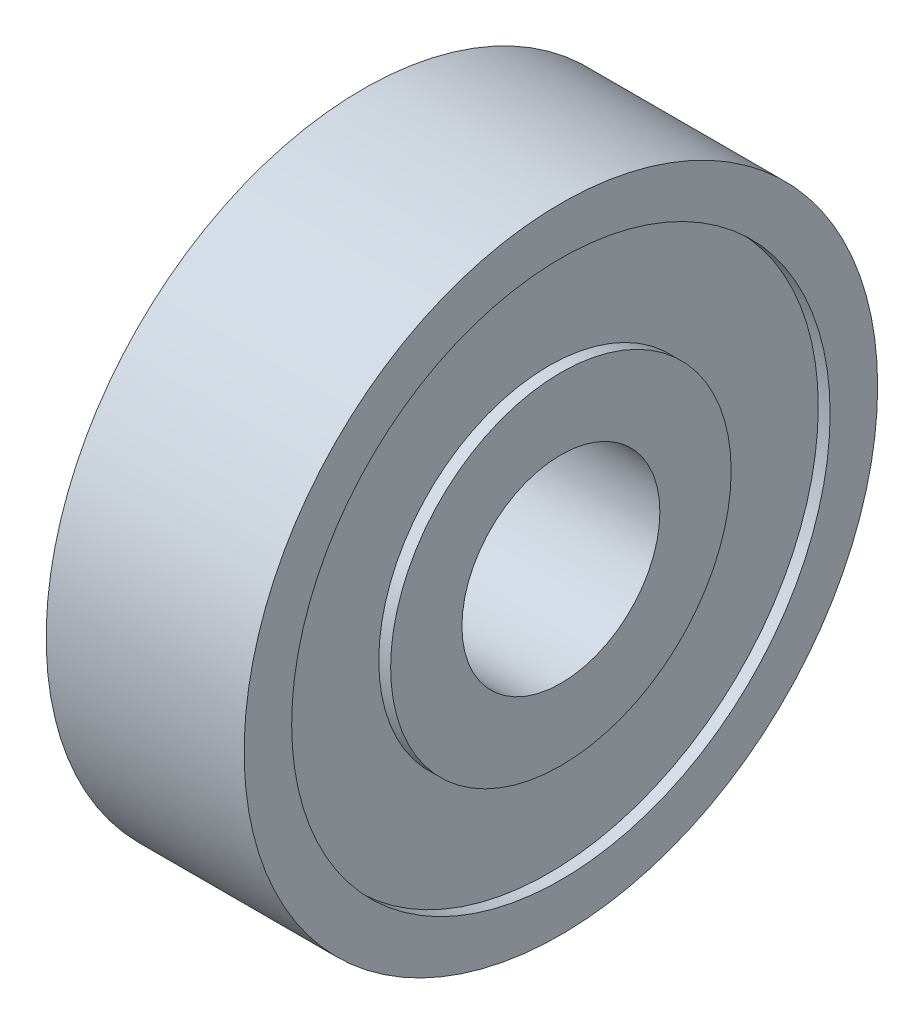
ISO-10303-21;
HEADER;
FILE_DESCRIPTION(('STEP AP214'),'2;1');
FILE_NAME('part.step','',(''),(''),'','','');
FILE_SCHEMA(('AUTOMOTIVE_DESIGN { 1 0 10303 214 1 1 1 1 }'));
ENDSEC;
DATA;
#1=APPLICATION_CONTEXT('core data for automotive mechanical design processes');
#2=APPLICATION_PROTOCOL_DEFINITION('international standard','automotive_design',2000,#1);
#3=PRODUCT_CONTEXT('',#1,'mechanical');
#4=PRODUCT('Part','Part','',(#3));
#5=PRODUCT_RELATED_PRODUCT_CATEGORY('part','',(#4));
#6=PRODUCT_DEFINITION_FORMATION('','',#4);
#7=PRODUCT_DEFINITION_CONTEXT('part definition',#1,'design');
#8=PRODUCT_DEFINITION('design','',#6,#7);
#9=PRODUCT_DEFINITION_SHAPE('','',#8);
#10=(LENGTH_UNIT() NAMED_UNIT(*) SI_UNIT(.MILLI.,.METRE.));
#11=(NAMED_UNIT(*) PLANE_ANGLE_UNIT() SI_UNIT($,.RADIAN.));
#12=(NAMED_UNIT(*) SI_UNIT($,.STERADIAN.) SOLID_ANGLE_UNIT());
#13=UNCERTAINTY_MEASURE_WITH_UNIT(LENGTH_MEASURE(1.E-05),#10,'distance_accuracy_value','');
#14=(GEOMETRIC_REPRESENTATION_CONTEXT(3) GLOBAL_UNCERTAINTY_ASSIGNED_CONTEXT((#13)) GLOBAL_UNIT_ASSIGNED_CONTEXT((#10,
#11,#12)) REPRESENTATION_CONTEXT('',''));
#15=CARTESIAN_POINT('',(0.,0.,0.));
#16=DIRECTION('',(0.,0.,1.));
#17=DIRECTION('',(1.,0.,0.));
#18=AXIS2_PLACEMENT_3D('',#15,#16,#17);
#19=CARTESIAN_POINT('',(-2.5,2.5,0.));
#20=DIRECTION('',(-1.,0.,0.));
#21=DIRECTION('',(0.,0.,1.));
#22=AXIS2_PLACEMENT_3D('',#19,#20,#21);
#23=PLANE('',#22);
#24=CARTESIAN_POINT('',(-2.5,0.,0.));
#25=DIRECTION('',(1.,0.,0.));
#26=DIRECTION('',(0.,0.,-1.));
#27=AXIS2_PLACEMENT_3D('',#24,#25,#26);
#28=CIRCLE('',#27,2.5);
#29=CARTESIAN_POINT('',(-2.5,0.,-2.5));
#30=VERTEX_POINT('',#29);
#31=EDGE_CURVE('E74',#30,#30,#28,.T.);
#32=ORIENTED_EDGE('',*,*,#31,.T.);
#33=EDGE_LOOP('',(#32));
#34=FACE_BOUND('',#33,.T.);
#35=CARTESIAN_POINT('',(-2.5,0.,0.));
#36=DIRECTION('',(1.,0.,0.));
#37=DIRECTION('',(0.,0.,-1.));
#38=AXIS2_PLACEMENT_3D('',#35,#36,#37);
#39=CIRCLE('',#38,4.3);
#40=CARTESIAN_POINT('',(-2.5,0.,-4.3));
#41=VERTEX_POINT('',#40);
#42=EDGE_CURVE('E10',#41,#41,#39,.T.);
#43=ORIENTED_EDGE('',*,*,#42,.F.);
#44=EDGE_LOOP('',(#43));
#45=FACE_BOUND('',#44,.T.);
#46=ADVANCED_FACE('F34',(#34,#45),#23,.T.);
#47=CARTESIAN_POINT('',(0.,0.,0.));
#48=DIRECTION('',(1.,0.,0.));
#49=DIRECTION('',(0.,0.,-1.));
#50=AXIS2_PLACEMENT_3D('',#47,#48,#49);
#51=CYLINDRICAL_SURFACE('',#50,4.3);
#52=ORIENTED_EDGE('',*,*,#42,.T.);
#53=EDGE_LOOP('',(#52));
#54=FACE_BOUND('',#53,.T.);
#55=CARTESIAN_POINT('',(-2.2,0.,0.));
#56=DIRECTION('',(1.,0.,0.));
#57=DIRECTION('',(0.,0.,-1.));
#58=AXIS2_PLACEMENT_3D('',#55,#56,#57);
#59=CIRCLE('',#58,4.3);
#60=CARTESIAN_POINT('',(-2.2,0.,-4.3));
#61=VERTEX_POINT('',#60);
#62=EDGE_CURVE('E40',#61,#61,#59,.T.);
#63=ORIENTED_EDGE('',*,*,#62,.F.);
#64=EDGE_LOOP('',(#63));
#65=FACE_BOUND('',#64,.T.);
#66=ADVANCED_FACE('F92',(#54,#65),#51,.T.);
#67=CARTESIAN_POINT('',(-2.2,4.3,0.));
#68=DIRECTION('',(-1.,0.,0.));
#69=DIRECTION('',(0.,0.,1.));
#70=AXIS2_PLACEMENT_3D('',#67,#68,#69);
#71=PLANE('',#70);
#72=ORIENTED_EDGE('',*,*,#62,.T.);
#73=EDGE_LOOP('',(#72));
#74=FACE_BOUND('',#73,.T.);
#75=CARTESIAN_POINT('',(-2.2,0.,0.));
#76=DIRECTION('',(1.,0.,0.));
#77=DIRECTION('',(0.,0.,-1.));
#78=AXIS2_PLACEMENT_3D('',#75,#76,#77);
#79=CIRCLE('',#78,6.8);
#80=CARTESIAN_POINT('',(-2.2,0.,-6.8));
#81=VERTEX_POINT('',#80);
#82=EDGE_CURVE('E44',#81,#81,#79,.T.);
#83=ORIENTED_EDGE('',*,*,#82,.F.);
#84=EDGE_LOOP('',(#83));
#85=FACE_BOUND('',#84,.T.);
#86=ADVANCED_FACE('F96',(#74,#85),#71,.T.);
#87=CARTESIAN_POINT('',(0.,0.,0.));
#88=DIRECTION('',(1.,0.,0.));
#89=DIRECTION('',(0.,0.,-1.));
#90=AXIS2_PLACEMENT_3D('',#87,#88,#89);
#91=CYLINDRICAL_SURFACE('',#90,6.8);
#92=ORIENTED_EDGE('',*,*,#82,.T.);
#93=EDGE_LOOP('',(#92));
#94=FACE_BOUND('',#93,.T.);
#95=CARTESIAN_POINT('',(-2.5,0.,0.));
#96=DIRECTION('',(1.,0.,0.));
#97=DIRECTION('',(0.,0.,-1.));
#98=AXIS2_PLACEMENT_3D('',#95,#96,#97);
#99=CIRCLE('',#98,6.8);
#100=CARTESIAN_POINT('',(-2.5,0.,-6.8));
#101=VERTEX_POINT('',#100);
#102=EDGE_CURVE('E48',#101,#101,#99,.T.);
#103=ORIENTED_EDGE('',*,*,#102,.F.);
#104=EDGE_LOOP('',(#103));
#105=FACE_BOUND('',#104,.T.);
#106=ADVANCED_FACE('F100',(#94,#105),#91,.F.);
#107=CARTESIAN_POINT('',(-2.5,6.8,0.));
#108=DIRECTION('',(-1.,0.,0.));
#109=DIRECTION('',(0.,0.,1.));
#110=AXIS2_PLACEMENT_3D('',#107,#108,#109);
#111=PLANE('',#110);
#112=ORIENTED_EDGE('',*,*,#102,.T.);
#113=EDGE_LOOP('',(#112));
#114=FACE_BOUND('',#113,.T.);
#115=CARTESIAN_POINT('',(-2.5,0.,0.));
#116=DIRECTION('',(1.,0.,0.));
#117=DIRECTION('',(0.,0.,-1.));
#118=AXIS2_PLACEMENT_3D('',#115,#116,#117);
#119=CIRCLE('',#118,8.);
#120=CARTESIAN_POINT('',(-2.5,0.,-8.));
#121=VERTEX_POINT('',#120);
#122=EDGE_CURVE('E53',#121,#121,#119,.T.);
#123=ORIENTED_EDGE('',*,*,#122,.F.);
#124=EDGE_LOOP('',(#123));
#125=FACE_BOUND('',#124,.T.);
#126=ADVANCED_FACE('F106',(#114,#125),#111,.T.);
#127=CARTESIAN_POINT('',(0.,0.,0.));
#128=DIRECTION('',(1.,0.,0.));
#129=DIRECTION('',(0.,0.,-1.));
#130=AXIS2_PLACEMENT_3D('',#127,#128,#129);
#131=CYLINDRICAL_SURFACE('',#130,8.);
#132=ORIENTED_EDGE('',*,*,#122,.T.);
#133=EDGE_LOOP('',(#132));
#134=FACE_BOUND('',#133,.T.);
#135=CARTESIAN_POINT('',(2.5,0.,0.));
#136=DIRECTION('',(1.,0.,0.));
#137=DIRECTION('',(0.,0.,-1.));
#138=AXIS2_PLACEMENT_3D('',#135,#136,#137);
#139=CIRCLE('',#138,8.);
#140=CARTESIAN_POINT('',(2.5,0.,-8.));
#141=VERTEX_POINT('',#140);
#142=EDGE_CURVE('E56',#141,#141,#139,.T.);
#143=ORIENTED_EDGE('',*,*,#142,.F.);
#144=EDGE_LOOP('',(#143));
#145=FACE_BOUND('',#144,.T.);
#146=ADVANCED_FACE('F110',(#134,#145),#131,.T.);
#147=CARTESIAN_POINT('',(2.5,6.8,0.));
#148=DIRECTION('',(1.,0.,0.));
#149=DIRECTION('',(0.,0.,-1.));
#150=AXIS2_PLACEMENT_3D('',#147,#148,#149);
#151=PLANE('',#150);
#152=ORIENTED_EDGE('',*,*,#142,.T.);
#153=EDGE_LOOP('',(#152));
#154=FACE_BOUND('',#153,.T.);
#155=CARTESIAN_POINT('',(2.5,0.,0.));
#156=DIRECTION('',(1.,0.,0.));
#157=DIRECTION('',(0.,0.,-1.));
#158=AXIS2_PLACEMENT_3D('',#155,#156,#157);
#159=CIRCLE('',#158,6.8);
#160=CARTESIAN_POINT('',(2.5,0.,-6.8));
#161=VERTEX_POINT('',#160);
#162=EDGE_CURVE('E59',#161,#161,#159,.T.);
#163=ORIENTED_EDGE('',*,*,#162,.F.);
#164=EDGE_LOOP('',(#163));
#165=FACE_BOUND('',#164,.T.);
#166=ADVANCED_FACE('F114',(#154,#165),#151,.T.);
#167=CARTESIAN_POINT('',(0.,0.,0.));
#168=DIRECTION('',(1.,0.,0.));
#169=DIRECTION('',(0.,0.,-1.));
#170=AXIS2_PLACEMENT_3D('',#167,#168,#169);
#171=CYLINDRICAL_SURFACE('',#170,6.8);
#172=ORIENTED_EDGE('',*,*,#162,.T.);
#173=EDGE_LOOP('',(#172));
#174=FACE_BOUND('',#173,.T.);
#175=CARTESIAN_POINT('',(2.2,0.,0.));
#176=DIRECTION('',(1.,0.,0.));
#177=DIRECTION('',(0.,0.,-1.));
#178=AXIS2_PLACEMENT_3D('',#175,#176,#177);
#179=CIRCLE('',#178,6.8);
#180=CARTESIAN_POINT('',(2.2,0.,-6.8));
#181=VERTEX_POINT('',#180);
#182=EDGE_CURVE('E62',#181,#181,#179,.T.);
#183=ORIENTED_EDGE('',*,*,#182,.F.);
#184=EDGE_LOOP('',(#183));
#185=FACE_BOUND('',#184,.T.);
#186=ADVANCED_FACE('F118',(#174,#185),#171,.F.);
#187=CARTESIAN_POINT('',(2.2,4.3,0.));
#188=DIRECTION('',(1.,0.,0.));
#189=DIRECTION('',(0.,0.,-1.));
#190=AXIS2_PLACEMENT_3D('',#187,#188,#189);
#191=PLANE('',#190);
#192=ORIENTED_EDGE('',*,*,#182,.T.);
#193=EDGE_LOOP('',(#192));
#194=FACE_BOUND('',#193,.T.);
#195=CARTESIAN_POINT('',(2.2,0.,0.));
#196=DIRECTION('',(1.,0.,0.));
#197=DIRECTION('',(0.,0.,-1.));
#198=AXIS2_PLACEMENT_3D('',#195,#196,#197);
#199=CIRCLE('',#198,4.3);
#200=CARTESIAN_POINT('',(2.2,0.,-4.3));
#201=VERTEX_POINT('',#200);
#202=EDGE_CURVE('E65',#201,#201,#199,.T.);
#203=ORIENTED_EDGE('',*,*,#202,.F.);
#204=EDGE_LOOP('',(#203));
#205=FACE_BOUND('',#204,.T.);
#206=ADVANCED_FACE('F122',(#194,#205),#191,.T.);
#207=CARTESIAN_POINT('',(0.,0.,0.));
#208=DIRECTION('',(1.,0.,0.));
#209=DIRECTION('',(0.,0.,-1.));
#210=AXIS2_PLACEMENT_3D('',#207,#208,#209);
#211=CYLINDRICAL_SURFACE('',#210,4.3);
#212=ORIENTED_EDGE('',*,*,#202,.T.);
#213=EDGE_LOOP('',(#212));
#214=FACE_BOUND('',#213,.T.);
#215=CARTESIAN_POINT('',(2.5,0.,0.));
#216=DIRECTION('',(1.,0.,0.));
#217=DIRECTION('',(0.,0.,-1.));
#218=AXIS2_PLACEMENT_3D('',#215,#216,#217);
#219=CIRCLE('',#218,4.3);
#220=CARTESIAN_POINT('',(2.5,0.,-4.3));
#221=VERTEX_POINT('',#220);
#222=EDGE_CURVE('E68',#221,#221,#219,.T.);
#223=ORIENTED_EDGE('',*,*,#222,.F.);
#224=EDGE_LOOP('',(#223));
#225=FACE_BOUND('',#224,.T.);
#226=ADVANCED_FACE('F88',(#214,#225),#211,.T.);
#227=CARTESIAN_POINT('',(2.5,2.5,0.));
#228=DIRECTION('',(1.,0.,0.));
#229=DIRECTION('',(0.,0.,-1.));
#230=AXIS2_PLACEMENT_3D('',#227,#228,#229);
#231=PLANE('',#230);
#232=ORIENTED_EDGE('',*,*,#222,.T.);
#233=EDGE_LOOP('',(#232));
#234=FACE_BOUND('',#233,.T.);
#235=CARTESIAN_POINT('',(2.5,0.,0.));
#236=DIRECTION('',(1.,0.,0.));
#237=DIRECTION('',(0.,0.,-1.));
#238=AXIS2_PLACEMENT_3D('',#235,#236,#237);
#239=CIRCLE('',#238,2.5);
#240=CARTESIAN_POINT('',(2.5,0.,-2.5));
#241=VERTEX_POINT('',#240);
#242=EDGE_CURVE('E71',#241,#241,#239,.T.);
#243=ORIENTED_EDGE('',*,*,#242,.F.);
#244=EDGE_LOOP('',(#243));
#245=FACE_BOUND('',#244,.T.);
#246=ADVANCED_FACE('F82',(#234,#245),#231,.T.);
#247=CARTESIAN_POINT('',(0.,0.,0.));
#248=DIRECTION('',(1.,0.,0.));
#249=DIRECTION('',(0.,0.,-1.));
#250=AXIS2_PLACEMENT_3D('',#247,#248,#249);
#251=CYLINDRICAL_SURFACE('',#250,2.5);
#252=ORIENTED_EDGE('',*,*,#242,.T.);
#253=EDGE_LOOP('',(#252));
#254=FACE_BOUND('',#253,.T.);
#255=ORIENTED_EDGE('',*,*,#31,.F.);
#256=EDGE_LOOP('',(#255));
#257=FACE_BOUND('',#256,.T.);
#258=ADVANCED_FACE('F80',(#254,#257),#251,.F.);
#259=CLOSED_SHELL('',(#46,#66,#86,#106,#126,#146,#166,#186,#206,#226,#246,#258));
#260=MANIFOLD_SOLID_BREP('B2',#259);
#261=ADVANCED_BREP_SHAPE_REPRESENTATION('',(#18,#260),#14);
#262=SHAPE_DEFINITION_REPRESENTATION(#9,#261);
ENDSEC;
END-ISO-10303-21;
